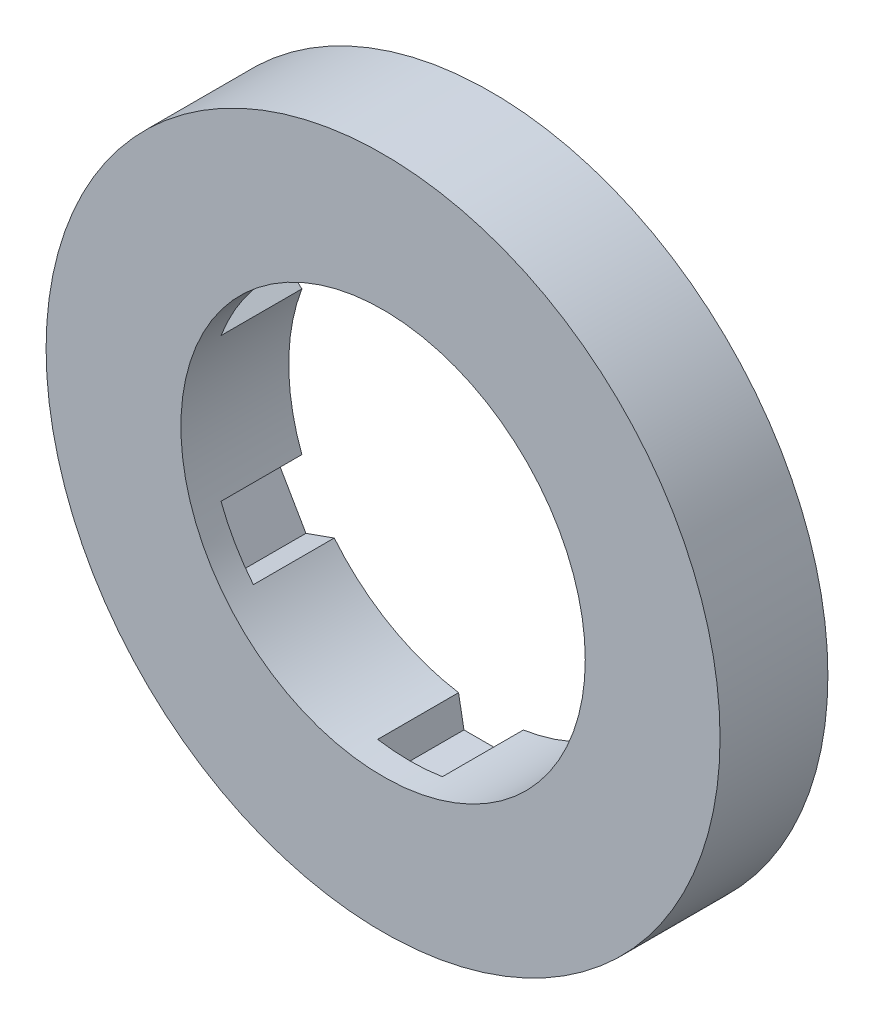
ISO-10303-21;
HEADER;
FILE_DESCRIPTION(('STEP AP214'),'2;1');
FILE_NAME('part.step','',(''),(''),'','','');
FILE_SCHEMA(('AUTOMOTIVE_DESIGN { 1 0 10303 214 1 1 1 1 }'));
ENDSEC;
DATA;
#1=APPLICATION_CONTEXT('core data for automotive mechanical design processes');
#2=APPLICATION_PROTOCOL_DEFINITION('international standard','automotive_design',2000,#1);
#3=PRODUCT_CONTEXT('',#1,'mechanical');
#4=PRODUCT('Part','Part','',(#3));
#5=PRODUCT_RELATED_PRODUCT_CATEGORY('part','',(#4));
#6=PRODUCT_DEFINITION_FORMATION('','',#4);
#7=PRODUCT_DEFINITION_CONTEXT('part definition',#1,'design');
#8=PRODUCT_DEFINITION('design','',#6,#7);
#9=PRODUCT_DEFINITION_SHAPE('','',#8);
#10=(LENGTH_UNIT() NAMED_UNIT(*) SI_UNIT(.MILLI.,.METRE.));
#11=(NAMED_UNIT(*) PLANE_ANGLE_UNIT() SI_UNIT($,.RADIAN.));
#12=(NAMED_UNIT(*) SI_UNIT($,.STERADIAN.) SOLID_ANGLE_UNIT());
#13=UNCERTAINTY_MEASURE_WITH_UNIT(LENGTH_MEASURE(1.E-05),#10,'distance_accuracy_value','');
#14=(GEOMETRIC_REPRESENTATION_CONTEXT(3) GLOBAL_UNCERTAINTY_ASSIGNED_CONTEXT((#13)) GLOBAL_UNIT_ASSIGNED_CONTEXT((#10,
#11,#12)) REPRESENTATION_CONTEXT('',''));
#15=CARTESIAN_POINT('',(0.,0.,0.));
#16=DIRECTION('',(0.,0.,1.));
#17=DIRECTION('',(1.,0.,0.));
#18=AXIS2_PLACEMENT_3D('',#15,#16,#17);
#19=CARTESIAN_POINT('',(0.,0.,3.));
#20=DIRECTION('',(0.,0.,1.));
#21=DIRECTION('',(1.,0.,0.));
#22=AXIS2_PLACEMENT_3D('',#19,#20,#21);
#23=CYLINDRICAL_SURFACE('',#22,12.5);
#24=CARTESIAN_POINT('',(0.,0.,3.));
#25=DIRECTION('',(0.,0.,1.));
#26=DIRECTION('',(1.,0.,0.));
#27=AXIS2_PLACEMENT_3D('',#24,#25,#26);
#28=CIRCLE('',#27,12.5);
#29=CARTESIAN_POINT('',(12.5,0.,3.));
#30=VERTEX_POINT('',#29);
#31=EDGE_CURVE('E354',#30,#30,#28,.T.);
#32=ORIENTED_EDGE('',*,*,#31,.T.);
#33=EDGE_LOOP('',(#32));
#34=FACE_BOUND('',#33,.T.);
#35=CARTESIAN_POINT('',(0.,0.,7.));
#36=DIRECTION('',(0.,0.,1.));
#37=DIRECTION('',(1.,0.,0.));
#38=AXIS2_PLACEMENT_3D('',#35,#36,#37);
#39=CIRCLE('',#38,12.5);
#40=CARTESIAN_POINT('',(12.5,0.,7.));
#41=VERTEX_POINT('',#40);
#42=EDGE_CURVE('E358',#41,#41,#39,.T.);
#43=ORIENTED_EDGE('',*,*,#42,.F.);
#44=EDGE_LOOP('',(#43));
#45=FACE_BOUND('',#44,.T.);
#46=ADVANCED_FACE('F34',(#34,#45),#23,.T.);
#47=CARTESIAN_POINT('',(0.,0.,3.));
#48=DIRECTION('',(0.,0.,1.));
#49=DIRECTION('',(1.,0.,0.));
#50=AXIS2_PLACEMENT_3D('',#47,#48,#49);
#51=PLANE('',#50);
#52=CARTESIAN_POINT('',(0.,0.,3.));
#53=DIRECTION('',(0.,0.,1.));
#54=DIRECTION('',(1.,0.,0.));
#55=AXIS2_PLACEMENT_3D('',#52,#53,#54);
#56=CIRCLE('',#55,7.5);
#57=CARTESIAN_POINT('',(5.8115130819487,4.74091928831731,3.));
#58=VERTEX_POINT('',#57);
#59=CARTESIAN_POINT('',(1.2,7.40337760755184,3.));
#60=VERTEX_POINT('',#59);
#61=EDGE_CURVE('E350',#58,#60,#56,.T.);
#62=ORIENTED_EDGE('',*,*,#61,.T.);
#63=DIRECTION('',(0.179418697155073,-0.983772804620648,0.));
#64=VECTOR('',#63,1.);
#65=CARTESIAN_POINT('',(1.2,7.40337760755184,3.));
#66=LINE('',#65,#64);
#67=CARTESIAN_POINT('',(1.,8.5,3.));
#68=VERTEX_POINT('',#67);
#69=EDGE_CURVE('E208',#68,#60,#66,.T.);
#70=ORIENTED_EDGE('',*,*,#69,.F.);
#71=DIRECTION('',(1.,0.,0.));
#72=VECTOR('',#71,1.);
#73=CARTESIAN_POINT('',(1.,8.5,3.));
#74=LINE('',#73,#72);
#75=CARTESIAN_POINT('',(-1.,8.5,3.));
#76=VERTEX_POINT('',#75);
#77=EDGE_CURVE('E427',#76,#68,#74,.T.);
#78=ORIENTED_EDGE('',*,*,#77,.F.);
#79=DIRECTION('',(0.179418697155073,0.983772804620648,0.));
#80=VECTOR('',#79,1.);
#81=CARTESIAN_POINT('',(-1.,8.5,3.));
#82=LINE('',#81,#80);
#83=CARTESIAN_POINT('',(-1.2,7.40337760755184,3.));
#84=VERTEX_POINT('',#83);
#85=EDGE_CURVE('E266',#84,#76,#82,.T.);
#86=ORIENTED_EDGE('',*,*,#85,.F.);
#87=CARTESIAN_POINT('',(-5.8115130819486,4.74091928831724,3.));
#88=VERTEX_POINT('',#87);
#89=EDGE_CURVE('E215',#84,#88,#56,.T.);
#90=ORIENTED_EDGE('',*,*,#89,.T.);
#91=DIRECTION('',(0.941681588931284,-0.336505252660122,0.));
#92=VECTOR('',#91,1.);
#93=CARTESIAN_POINT('',(-5.8115130819486,4.74091928831724,3.));
#94=LINE('',#93,#92);
#95=CARTESIAN_POINT('',(-6.86121593216757,5.11602540378444,3.));
#96=VERTEX_POINT('',#95);
#97=EDGE_CURVE('E250',#96,#88,#94,.T.);
#98=ORIENTED_EDGE('',*,*,#97,.F.);
#99=DIRECTION('',(0.499999999999998,0.86602540378444,0.));
#100=VECTOR('',#99,1.);
#101=CARTESIAN_POINT('',(-6.86121593216757,5.11602540378444,3.));
#102=LINE('',#101,#100);
#103=CARTESIAN_POINT('',(-7.86121593216757,3.38397459621556,3.));
#104=VERTEX_POINT('',#103);
#105=EDGE_CURVE('E259',#104,#96,#102,.T.);
#106=ORIENTED_EDGE('',*,*,#105,.F.);
#107=DIRECTION('',(-0.762262891776205,0.64726755196053,0.));
#108=VECTOR('',#107,1.);
#109=CARTESIAN_POINT('',(-7.86121593216757,3.38397459621556,3.));
#110=LINE('',#109,#108);
#111=CARTESIAN_POINT('',(-7.0115130819486,2.66245831923459,3.));
#112=VERTEX_POINT('',#111);
#113=EDGE_CURVE('E256',#112,#104,#110,.T.);
#114=ORIENTED_EDGE('',*,*,#113,.F.);
#115=CARTESIAN_POINT('',(-7.01151308194879,-2.66245831923461,3.));
#116=VERTEX_POINT('',#115);
#117=EDGE_CURVE('E412',#112,#116,#56,.T.);
#118=ORIENTED_EDGE('',*,*,#117,.T.);
#119=DIRECTION('',(0.762262891776207,0.647267551960527,0.));
#120=VECTOR('',#119,1.);
#121=CARTESIAN_POINT('',(-7.01151308194879,-2.66245831923461,3.));
#122=LINE('',#121,#120);
#123=CARTESIAN_POINT('',(-7.86121593216776,-3.38397459621558,3.));
#124=VERTEX_POINT('',#123);
#125=EDGE_CURVE('E276',#124,#116,#122,.T.);
#126=ORIENTED_EDGE('',*,*,#125,.F.);
#127=DIRECTION('',(-0.5,0.866025403784439,0.));
#128=VECTOR('',#127,1.);
#129=CARTESIAN_POINT('',(-7.86121593216776,-3.38397459621558,3.));
#130=LINE('',#129,#128);
#131=CARTESIAN_POINT('',(-6.86121593216777,-5.11602540378445,3.));
#132=VERTEX_POINT('',#131);
#133=EDGE_CURVE('E285',#132,#124,#130,.T.);
#134=ORIENTED_EDGE('',*,*,#133,.F.);
#135=DIRECTION('',(-0.941681588931285,-0.336505252660119,0.));
#136=VECTOR('',#135,1.);
#137=CARTESIAN_POINT('',(-6.86121593216777,-5.11602540378445,3.));
#138=LINE('',#137,#136);
#139=CARTESIAN_POINT('',(-5.81151308194879,-4.74091928831726,3.));
#140=VERTEX_POINT('',#139);
#141=EDGE_CURVE('E282',#140,#132,#138,.T.);
#142=ORIENTED_EDGE('',*,*,#141,.F.);
#143=CARTESIAN_POINT('',(-1.20000000000003,-7.40337760755187,3.));
#144=VERTEX_POINT('',#143);
#145=EDGE_CURVE('E410',#140,#144,#56,.T.);
#146=ORIENTED_EDGE('',*,*,#145,.T.);
#147=DIRECTION('',(-0.179418697155077,0.983772804620648,0.));
#148=VECTOR('',#147,1.);
#149=CARTESIAN_POINT('',(-1.20000000000003,-7.40337760755187,3.));
#150=LINE('',#149,#148);
#151=CARTESIAN_POINT('',(-1.00000000000003,-8.50000000000003,3.));
#152=VERTEX_POINT('',#151);
#153=EDGE_CURVE('E301',#152,#144,#150,.T.);
#154=ORIENTED_EDGE('',*,*,#153,.F.);
#155=DIRECTION('',(-1.,0.,0.));
#156=VECTOR('',#155,1.);
#157=CARTESIAN_POINT('',(-1.00000000000003,-8.50000000000003,3.));
#158=LINE('',#157,#156);
#159=CARTESIAN_POINT('',(0.999999999999966,-8.50000000000003,3.));
#160=VERTEX_POINT('',#159);
#161=EDGE_CURVE('E310',#160,#152,#158,.T.);
#162=ORIENTED_EDGE('',*,*,#161,.F.);
#163=DIRECTION('',(-0.179418697155078,-0.983772804620648,0.));
#164=VECTOR('',#163,1.);
#165=CARTESIAN_POINT('',(0.999999999999966,-8.50000000000003,3.));
#166=LINE('',#165,#164);
#167=CARTESIAN_POINT('',(1.19999999999997,-7.40337760755187,3.));
#168=VERTEX_POINT('',#167);
#169=EDGE_CURVE('E307',#168,#160,#166,.T.);
#170=ORIENTED_EDGE('',*,*,#169,.F.);
#171=CARTESIAN_POINT('',(5.81151308194874,-4.74091928831728,3.));
#172=VERTEX_POINT('',#171);
#173=EDGE_CURVE('E348',#168,#172,#56,.T.);
#174=ORIENTED_EDGE('',*,*,#173,.T.);
#175=DIRECTION('',(-0.941681588931285,0.33650525266012,0.));
#176=VECTOR('',#175,1.);
#177=CARTESIAN_POINT('',(5.81151308194874,-4.74091928831728,3.));
#178=LINE('',#177,#176);
#179=CARTESIAN_POINT('',(6.86121593216772,-5.11602540378447,3.));
#180=VERTEX_POINT('',#179);
#181=EDGE_CURVE('E326',#180,#172,#178,.T.);
#182=ORIENTED_EDGE('',*,*,#181,.F.);
#183=DIRECTION('',(-0.500000000000001,-0.866025403784438,0.));
#184=VECTOR('',#183,1.);
#185=CARTESIAN_POINT('',(6.86121593216772,-5.11602540378447,3.));
#186=LINE('',#185,#184);
#187=CARTESIAN_POINT('',(7.86121593216772,-3.3839745962156,3.));
#188=VERTEX_POINT('',#187);
#189=EDGE_CURVE('E334',#188,#180,#186,.T.);
#190=ORIENTED_EDGE('',*,*,#189,.F.);
#191=DIRECTION('',(0.762262891776207,-0.647267551960527,0.));
#192=VECTOR('',#191,1.);
#193=CARTESIAN_POINT('',(7.86121593216772,-3.3839745962156,3.));
#194=LINE('',#193,#192);
#195=CARTESIAN_POINT('',(7.01151308194874,-2.66245831923463,3.));
#196=VERTEX_POINT('',#195);
#197=EDGE_CURVE('E240',#196,#188,#194,.T.);
#198=ORIENTED_EDGE('',*,*,#197,.F.);
#199=CARTESIAN_POINT('',(7.01151308194872,2.66245831923468,3.));
#200=VERTEX_POINT('',#199);
#201=EDGE_CURVE('E345',#196,#200,#56,.T.);
#202=ORIENTED_EDGE('',*,*,#201,.T.);
#203=DIRECTION('',(-0.762262891776269,-0.647267551960454,0.));
#204=VECTOR('',#203,1.);
#205=CARTESIAN_POINT('',(7.01151308194872,2.66245831923468,3.));
#206=LINE('',#205,#204);
#207=CARTESIAN_POINT('',(7.86121593216773,3.38397459621554,3.));
#208=VERTEX_POINT('',#207);
#209=EDGE_CURVE('E226',#208,#200,#206,.T.);
#210=ORIENTED_EDGE('',*,*,#209,.F.);
#211=DIRECTION('',(0.500000000000002,-0.866025403784437,0.));
#212=VECTOR('',#211,1.);
#213=CARTESIAN_POINT('',(7.86121593216773,3.38397459621554,3.));
#214=LINE('',#213,#212);
#215=CARTESIAN_POINT('',(6.86121593216767,5.11602540378452,3.));
#216=VERTEX_POINT('',#215);
#217=EDGE_CURVE('E233',#216,#208,#214,.T.);
#218=ORIENTED_EDGE('',*,*,#217,.F.);
#219=DIRECTION('',(0.941681588931279,0.336505252660135,0.));
#220=VECTOR('',#219,1.);
#221=CARTESIAN_POINT('',(6.86121593216767,5.11602540378452,3.));
#222=LINE('',#221,#220);
#223=EDGE_CURVE('E230',#58,#216,#222,.T.);
#224=ORIENTED_EDGE('',*,*,#223,.F.);
#225=EDGE_LOOP('',(#62,#70,#78,#86,#90,#98,#106,#114,#118,#126,#134,#142,#146,#154,#162,#170,
#174,#182,#190,#198,#202,#210,#218,#224));
#226=FACE_BOUND('',#225,.T.);
#227=ORIENTED_EDGE('',*,*,#31,.F.);
#228=EDGE_LOOP('',(#227));
#229=FACE_BOUND('',#228,.T.);
#230=ADVANCED_FACE('F389',(#226,#229),#51,.F.);
#231=CARTESIAN_POINT('',(0.,0.,7.));
#232=DIRECTION('',(0.,0.,1.));
#233=DIRECTION('',(1.,0.,0.));
#234=AXIS2_PLACEMENT_3D('',#231,#232,#233);
#235=PLANE('',#234);
#236=CARTESIAN_POINT('',(0.,0.,7.));
#237=DIRECTION('',(0.,0.,1.));
#238=DIRECTION('',(1.,0.,0.));
#239=AXIS2_PLACEMENT_3D('',#236,#237,#238);
#240=CIRCLE('',#239,7.5);
#241=CARTESIAN_POINT('',(7.5,0.,7.));
#242=VERTEX_POINT('',#241);
#243=EDGE_CURVE('E349',#242,#242,#240,.T.);
#244=ORIENTED_EDGE('',*,*,#243,.F.);
#245=EDGE_LOOP('',(#244));
#246=FACE_BOUND('',#245,.T.);
#247=ORIENTED_EDGE('',*,*,#42,.T.);
#248=EDGE_LOOP('',(#247));
#249=FACE_BOUND('',#248,.T.);
#250=ADVANCED_FACE('F447',(#246,#249),#235,.T.);
#251=CARTESIAN_POINT('',(0.,0.,3.));
#252=DIRECTION('',(0.,0.,1.));
#253=DIRECTION('',(1.,0.,0.));
#254=AXIS2_PLACEMENT_3D('',#251,#252,#253);
#255=CYLINDRICAL_SURFACE('',#254,7.5);
#256=CARTESIAN_POINT('',(0.,0.,6.));
#257=DIRECTION('',(0.,0.,1.));
#258=DIRECTION('',(1.,0.,0.));
#259=AXIS2_PLACEMENT_3D('',#256,#257,#258);
#260=CIRCLE('',#259,7.5);
#261=CARTESIAN_POINT('',(-1.2,7.40337760755184,6.));
#262=VERTEX_POINT('',#261);
#263=CARTESIAN_POINT('',(1.2,7.40337760755184,6.));
#264=VERTEX_POINT('',#263);
#265=EDGE_CURVE('E11',#262,#264,#260,.F.);
#266=ORIENTED_EDGE('',*,*,#265,.T.);
#267=DIRECTION('',(0.,0.,-1.));
#268=VECTOR('',#267,1.);
#269=CARTESIAN_POINT('',(1.2,7.40337760755184,6.));
#270=LINE('',#269,#268);
#271=EDGE_CURVE('E353',#264,#60,#270,.T.);
#272=ORIENTED_EDGE('',*,*,#271,.T.);
#273=ORIENTED_EDGE('',*,*,#61,.F.);
#274=DIRECTION('',(0.,0.,-1.));
#275=VECTOR('',#274,1.);
#276=CARTESIAN_POINT('',(5.8115130819487,4.74091928831731,6.));
#277=LINE('',#276,#275);
#278=CARTESIAN_POINT('',(5.8115130819487,4.74091928831731,6.));
#279=VERTEX_POINT('',#278);
#280=EDGE_CURVE('E229',#279,#58,#277,.T.);
#281=ORIENTED_EDGE('',*,*,#280,.F.);
#282=CARTESIAN_POINT('',(0.,0.,6.));
#283=DIRECTION('',(0.,0.,1.));
#284=DIRECTION('',(1.,0.,0.));
#285=AXIS2_PLACEMENT_3D('',#282,#283,#284);
#286=CIRCLE('',#285,7.5);
#287=CARTESIAN_POINT('',(7.01151308194872,2.66245831923468,6.));
#288=VERTEX_POINT('',#287);
#289=EDGE_CURVE('E41',#279,#288,#286,.F.);
#290=ORIENTED_EDGE('',*,*,#289,.T.);
#291=DIRECTION('',(0.,0.,-1.));
#292=VECTOR('',#291,1.);
#293=CARTESIAN_POINT('',(7.01151308194872,2.66245831923468,6.));
#294=LINE('',#293,#292);
#295=EDGE_CURVE('E237',#288,#200,#294,.T.);
#296=ORIENTED_EDGE('',*,*,#295,.T.);
#297=ORIENTED_EDGE('',*,*,#201,.F.);
#298=DIRECTION('',(0.,0.,-1.));
#299=VECTOR('',#298,1.);
#300=CARTESIAN_POINT('',(7.01151308194874,-2.66245831923463,6.));
#301=LINE('',#300,#299);
#302=CARTESIAN_POINT('',(7.01151308194874,-2.66245831923463,6.));
#303=VERTEX_POINT('',#302);
#304=EDGE_CURVE('E331',#303,#196,#301,.T.);
#305=ORIENTED_EDGE('',*,*,#304,.F.);
#306=CARTESIAN_POINT('',(0.,0.,6.));
#307=DIRECTION('',(0.,0.,1.));
#308=DIRECTION('',(1.,0.,0.));
#309=AXIS2_PLACEMENT_3D('',#306,#307,#308);
#310=CIRCLE('',#309,7.5);
#311=CARTESIAN_POINT('',(5.81151308194873,-4.74091928831728,6.));
#312=VERTEX_POINT('',#311);
#313=EDGE_CURVE('E369',#303,#312,#310,.F.);
#314=ORIENTED_EDGE('',*,*,#313,.T.);
#315=DIRECTION('',(0.,0.,-1.));
#316=VECTOR('',#315,1.);
#317=CARTESIAN_POINT('',(5.81151308194874,-4.74091928831728,6.));
#318=LINE('',#317,#316);
#319=EDGE_CURVE('E311',#312,#172,#318,.T.);
#320=ORIENTED_EDGE('',*,*,#319,.T.);
#321=ORIENTED_EDGE('',*,*,#173,.F.);
#322=DIRECTION('',(0.,0.,-1.));
#323=VECTOR('',#322,1.);
#324=CARTESIAN_POINT('',(1.19999999999997,-7.40337760755187,6.));
#325=LINE('',#324,#323);
#326=CARTESIAN_POINT('',(1.19999999999997,-7.40337760755187,6.));
#327=VERTEX_POINT('',#326);
#328=EDGE_CURVE('E306',#327,#168,#325,.T.);
#329=ORIENTED_EDGE('',*,*,#328,.F.);
#330=CARTESIAN_POINT('',(0.,0.,6.));
#331=DIRECTION('',(0.,0.,1.));
#332=DIRECTION('',(1.,0.,0.));
#333=AXIS2_PLACEMENT_3D('',#330,#331,#332);
#334=CIRCLE('',#333,7.5);
#335=CARTESIAN_POINT('',(-1.19999999999981,-7.40337760755187,6.));
#336=VERTEX_POINT('',#335);
#337=EDGE_CURVE('E366',#327,#336,#334,.F.);
#338=ORIENTED_EDGE('',*,*,#337,.T.);
#339=DIRECTION('',(0.,0.,-1.));
#340=VECTOR('',#339,1.);
#341=CARTESIAN_POINT('',(-1.20000000000003,-7.40337760755187,6.));
#342=LINE('',#341,#340);
#343=EDGE_CURVE('E286',#336,#144,#342,.T.);
#344=ORIENTED_EDGE('',*,*,#343,.T.);
#345=ORIENTED_EDGE('',*,*,#145,.F.);
#346=DIRECTION('',(0.,0.,-1.));
#347=VECTOR('',#346,1.);
#348=CARTESIAN_POINT('',(-5.81151308194879,-4.74091928831726,6.));
#349=LINE('',#348,#347);
#350=CARTESIAN_POINT('',(-5.81151308194879,-4.74091928831726,6.));
#351=VERTEX_POINT('',#350);
#352=EDGE_CURVE('E281',#351,#140,#349,.T.);
#353=ORIENTED_EDGE('',*,*,#352,.F.);
#354=CARTESIAN_POINT('',(0.,0.,6.));
#355=DIRECTION('',(0.,0.,1.));
#356=DIRECTION('',(1.,0.,0.));
#357=AXIS2_PLACEMENT_3D('',#354,#355,#356);
#358=CIRCLE('',#357,7.5);
#359=CARTESIAN_POINT('',(-7.01151308194867,-2.66245831923482,6.));
#360=VERTEX_POINT('',#359);
#361=EDGE_CURVE('E363',#351,#360,#358,.F.);
#362=ORIENTED_EDGE('',*,*,#361,.T.);
#363=DIRECTION('',(0.,0.,-1.));
#364=VECTOR('',#363,1.);
#365=CARTESIAN_POINT('',(-7.01151308194879,-2.66245831923461,6.));
#366=LINE('',#365,#364);
#367=EDGE_CURVE('E260',#360,#116,#366,.T.);
#368=ORIENTED_EDGE('',*,*,#367,.T.);
#369=ORIENTED_EDGE('',*,*,#117,.F.);
#370=DIRECTION('',(0.,0.,-1.));
#371=VECTOR('',#370,1.);
#372=CARTESIAN_POINT('',(-7.0115130819486,2.66245831923459,6.));
#373=LINE('',#372,#371);
#374=CARTESIAN_POINT('',(-7.0115130819486,2.66245831923459,6.));
#375=VERTEX_POINT('',#374);
#376=EDGE_CURVE('E255',#375,#112,#373,.T.);
#377=ORIENTED_EDGE('',*,*,#376,.F.);
#378=CARTESIAN_POINT('',(0.,0.,6.));
#379=DIRECTION('',(0.,0.,1.));
#380=DIRECTION('',(1.,0.,0.));
#381=AXIS2_PLACEMENT_3D('',#378,#379,#380);
#382=CIRCLE('',#381,7.5);
#383=CARTESIAN_POINT('',(-5.81151308194872,4.74091928831729,6.));
#384=VERTEX_POINT('',#383);
#385=EDGE_CURVE('E357',#375,#384,#382,.F.);
#386=ORIENTED_EDGE('',*,*,#385,.T.);
#387=DIRECTION('',(0.,0.,-1.));
#388=VECTOR('',#387,1.);
#389=CARTESIAN_POINT('',(-5.8115130819486,4.74091928831724,6.));
#390=LINE('',#389,#388);
#391=EDGE_CURVE('E264',#384,#88,#390,.T.);
#392=ORIENTED_EDGE('',*,*,#391,.T.);
#393=ORIENTED_EDGE('',*,*,#89,.F.);
#394=DIRECTION('',(0.,0.,-1.));
#395=VECTOR('',#394,1.);
#396=CARTESIAN_POINT('',(-1.2,7.40337760755184,6.));
#397=LINE('',#396,#395);
#398=EDGE_CURVE('E203',#262,#84,#397,.T.);
#399=ORIENTED_EDGE('',*,*,#398,.F.);
#400=EDGE_LOOP('',(#266,#272,#273,#281,#290,#296,#297,#305,#314,#320,#321,#329,#338,#344,#345,
#353,#362,#368,#369,#377,#386,#392,#393,#399));
#401=FACE_BOUND('',#400,.T.);
#402=ORIENTED_EDGE('',*,*,#243,.T.);
#403=EDGE_LOOP('',(#402));
#404=FACE_BOUND('',#403,.T.);
#405=ADVANCED_FACE('F211',(#401,#404),#255,.F.);
#406=CARTESIAN_POINT('',(0.,0.,6.));
#407=DIRECTION('',(0.,0.,1.));
#408=DIRECTION('',(1.,0.,0.));
#409=AXIS2_PLACEMENT_3D('',#406,#407,#408);
#410=PLANE('',#409);
#411=DIRECTION('',(-0.762262891776205,0.64726755196053,0.));
#412=VECTOR('',#411,1.);
#413=CARTESIAN_POINT('',(-7.86121593216757,3.38397459621556,6.));
#414=LINE('',#413,#412);
#415=CARTESIAN_POINT('',(-7.86121593216757,3.38397459621556,6.));
#416=VERTEX_POINT('',#415);
#417=EDGE_CURVE('E246',#375,#416,#414,.T.);
#418=ORIENTED_EDGE('',*,*,#417,.T.);
#419=DIRECTION('',(0.499999999999998,0.86602540378444,0.));
#420=VECTOR('',#419,1.);
#421=CARTESIAN_POINT('',(-6.86121593216757,5.11602540378444,6.));
#422=LINE('',#421,#420);
#423=CARTESIAN_POINT('',(-6.86121593216757,5.11602540378444,6.));
#424=VERTEX_POINT('',#423);
#425=EDGE_CURVE('E249',#416,#424,#422,.T.);
#426=ORIENTED_EDGE('',*,*,#425,.T.);
#427=DIRECTION('',(0.941681588931284,-0.336505252660122,0.));
#428=VECTOR('',#427,1.);
#429=CARTESIAN_POINT('',(-5.8115130819486,4.74091928831724,6.));
#430=LINE('',#429,#428);
#431=EDGE_CURVE('E253',#424,#384,#430,.T.);
#432=ORIENTED_EDGE('',*,*,#431,.T.);
#433=ORIENTED_EDGE('',*,*,#385,.F.);
#434=EDGE_LOOP('',(#418,#426,#432,#433));
#435=FACE_BOUND('',#434,.T.);
#436=ADVANCED_FACE('F458',(#435),#410,.F.);
#437=CARTESIAN_POINT('',(-5.8115130819486,4.74091928831724,6.));
#438=DIRECTION('',(0.336505252660122,0.941681588931284,0.));
#439=DIRECTION('',(-0.941681588931284,0.336505252660122,0.));
#440=AXIS2_PLACEMENT_3D('',#437,#438,#439);
#441=PLANE('',#440);
#442=ORIENTED_EDGE('',*,*,#97,.T.);
#443=ORIENTED_EDGE('',*,*,#391,.F.);
#444=ORIENTED_EDGE('',*,*,#431,.F.);
#445=DIRECTION('',(0.,0.,-1.));
#446=VECTOR('',#445,1.);
#447=CARTESIAN_POINT('',(-6.86121593216757,5.11602540378444,6.));
#448=LINE('',#447,#446);
#449=EDGE_CURVE('E267',#424,#96,#448,.T.);
#450=ORIENTED_EDGE('',*,*,#449,.T.);
#451=EDGE_LOOP('',(#442,#443,#444,#450));
#452=FACE_BOUND('',#451,.T.);
#453=ADVANCED_FACE('F511',(#452),#441,.F.);
#454=CARTESIAN_POINT('',(-6.86121593216757,5.11602540378444,6.));
#455=DIRECTION('',(-0.86602540378444,0.499999999999998,0.));
#456=DIRECTION('',(-0.499999999999998,-0.86602540378444,0.));
#457=AXIS2_PLACEMENT_3D('',#454,#455,#456);
#458=PLANE('',#457);
#459=ORIENTED_EDGE('',*,*,#105,.T.);
#460=ORIENTED_EDGE('',*,*,#449,.F.);
#461=ORIENTED_EDGE('',*,*,#425,.F.);
#462=DIRECTION('',(0.,0.,-1.));
#463=VECTOR('',#462,1.);
#464=CARTESIAN_POINT('',(-7.86121593216757,3.38397459621556,6.));
#465=LINE('',#464,#463);
#466=EDGE_CURVE('E269',#416,#104,#465,.T.);
#467=ORIENTED_EDGE('',*,*,#466,.T.);
#468=EDGE_LOOP('',(#459,#460,#461,#467));
#469=FACE_BOUND('',#468,.T.);
#470=ADVANCED_FACE('F507',(#469),#458,.F.);
#471=CARTESIAN_POINT('',(-7.86121593216757,3.38397459621556,6.));
#472=DIRECTION('',(-0.64726755196053,-0.762262891776205,0.));
#473=DIRECTION('',(0.762262891776205,-0.64726755196053,0.));
#474=AXIS2_PLACEMENT_3D('',#471,#472,#473);
#475=PLANE('',#474);
#476=ORIENTED_EDGE('',*,*,#113,.T.);
#477=ORIENTED_EDGE('',*,*,#466,.F.);
#478=ORIENTED_EDGE('',*,*,#417,.F.);
#479=ORIENTED_EDGE('',*,*,#376,.T.);
#480=EDGE_LOOP('',(#476,#477,#478,#479));
#481=FACE_BOUND('',#480,.T.);
#482=ADVANCED_FACE('F503',(#481),#475,.F.);
#483=CARTESIAN_POINT('',(0.,0.,6.));
#484=DIRECTION('',(0.,0.,1.));
#485=DIRECTION('',(1.,0.,0.));
#486=AXIS2_PLACEMENT_3D('',#483,#484,#485);
#487=PLANE('',#486);
#488=DIRECTION('',(-0.941681588931285,-0.336505252660119,0.));
#489=VECTOR('',#488,1.);
#490=CARTESIAN_POINT('',(-6.86121593216777,-5.11602540378445,6.));
#491=LINE('',#490,#489);
#492=CARTESIAN_POINT('',(-6.86121593216777,-5.11602540378445,6.));
#493=VERTEX_POINT('',#492);
#494=EDGE_CURVE('E272',#351,#493,#491,.T.);
#495=ORIENTED_EDGE('',*,*,#494,.T.);
#496=DIRECTION('',(-0.5,0.866025403784439,0.));
#497=VECTOR('',#496,1.);
#498=CARTESIAN_POINT('',(-7.86121593216776,-3.38397459621558,6.));
#499=LINE('',#498,#497);
#500=CARTESIAN_POINT('',(-7.86121593216776,-3.38397459621558,6.));
#501=VERTEX_POINT('',#500);
#502=EDGE_CURVE('E275',#493,#501,#499,.T.);
#503=ORIENTED_EDGE('',*,*,#502,.T.);
#504=DIRECTION('',(0.762262891776207,0.647267551960527,0.));
#505=VECTOR('',#504,1.);
#506=CARTESIAN_POINT('',(-7.01151308194879,-2.66245831923461,6.));
#507=LINE('',#506,#505);
#508=EDGE_CURVE('E279',#501,#360,#507,.T.);
#509=ORIENTED_EDGE('',*,*,#508,.T.);
#510=ORIENTED_EDGE('',*,*,#361,.F.);
#511=EDGE_LOOP('',(#495,#503,#509,#510));
#512=FACE_BOUND('',#511,.T.);
#513=ADVANCED_FACE('F499',(#512),#487,.F.);
#514=CARTESIAN_POINT('',(-7.01151308194879,-2.66245831923461,6.));
#515=DIRECTION('',(-0.647267551960527,0.762262891776207,0.));
#516=DIRECTION('',(-0.762262891776207,-0.647267551960527,0.));
#517=AXIS2_PLACEMENT_3D('',#514,#515,#516);
#518=PLANE('',#517);
#519=ORIENTED_EDGE('',*,*,#125,.T.);
#520=ORIENTED_EDGE('',*,*,#367,.F.);
#521=ORIENTED_EDGE('',*,*,#508,.F.);
#522=DIRECTION('',(0.,0.,-1.));
#523=VECTOR('',#522,1.);
#524=CARTESIAN_POINT('',(-7.86121593216776,-3.38397459621558,6.));
#525=LINE('',#524,#523);
#526=EDGE_CURVE('E292',#501,#124,#525,.T.);
#527=ORIENTED_EDGE('',*,*,#526,.T.);
#528=EDGE_LOOP('',(#519,#520,#521,#527));
#529=FACE_BOUND('',#528,.T.);
#530=ADVANCED_FACE('F495',(#529),#518,.F.);
#531=CARTESIAN_POINT('',(-7.86121593216776,-3.38397459621558,6.));
#532=DIRECTION('',(-0.866025403784439,-0.5,0.));
#533=DIRECTION('',(0.5,-0.866025403784439,0.));
#534=AXIS2_PLACEMENT_3D('',#531,#532,#533);
#535=PLANE('',#534);
#536=ORIENTED_EDGE('',*,*,#133,.T.);
#537=ORIENTED_EDGE('',*,*,#526,.F.);
#538=ORIENTED_EDGE('',*,*,#502,.F.);
#539=DIRECTION('',(0.,0.,-1.));
#540=VECTOR('',#539,1.);
#541=CARTESIAN_POINT('',(-6.86121593216777,-5.11602540378445,6.));
#542=LINE('',#541,#540);
#543=EDGE_CURVE('E294',#493,#132,#542,.T.);
#544=ORIENTED_EDGE('',*,*,#543,.T.);
#545=EDGE_LOOP('',(#536,#537,#538,#544));
#546=FACE_BOUND('',#545,.T.);
#547=ADVANCED_FACE('F491',(#546),#535,.F.);
#548=CARTESIAN_POINT('',(-6.86121593216777,-5.11602540378445,6.));
#549=DIRECTION('',(0.336505252660119,-0.941681588931285,0.));
#550=DIRECTION('',(0.941681588931285,0.336505252660119,0.));
#551=AXIS2_PLACEMENT_3D('',#548,#549,#550);
#552=PLANE('',#551);
#553=ORIENTED_EDGE('',*,*,#141,.T.);
#554=ORIENTED_EDGE('',*,*,#543,.F.);
#555=ORIENTED_EDGE('',*,*,#494,.F.);
#556=ORIENTED_EDGE('',*,*,#352,.T.);
#557=EDGE_LOOP('',(#553,#554,#555,#556));
#558=FACE_BOUND('',#557,.T.);
#559=ADVANCED_FACE('F487',(#558),#552,.F.);
#560=CARTESIAN_POINT('',(0.,0.,6.));
#561=DIRECTION('',(0.,0.,1.));
#562=DIRECTION('',(1.,0.,0.));
#563=AXIS2_PLACEMENT_3D('',#560,#561,#562);
#564=PLANE('',#563);
#565=DIRECTION('',(-0.179418697155078,-0.983772804620648,0.));
#566=VECTOR('',#565,1.);
#567=CARTESIAN_POINT('',(0.999999999999966,-8.50000000000003,6.));
#568=LINE('',#567,#566);
#569=CARTESIAN_POINT('',(0.999999999999966,-8.50000000000003,6.));
#570=VERTEX_POINT('',#569);
#571=EDGE_CURVE('E297',#327,#570,#568,.T.);
#572=ORIENTED_EDGE('',*,*,#571,.T.);
#573=DIRECTION('',(-1.,0.,0.));
#574=VECTOR('',#573,1.);
#575=CARTESIAN_POINT('',(-1.00000000000003,-8.50000000000003,6.));
#576=LINE('',#575,#574);
#577=CARTESIAN_POINT('',(-1.00000000000003,-8.50000000000003,6.));
#578=VERTEX_POINT('',#577);
#579=EDGE_CURVE('E300',#570,#578,#576,.T.);
#580=ORIENTED_EDGE('',*,*,#579,.T.);
#581=DIRECTION('',(-0.179418697155077,0.983772804620648,0.));
#582=VECTOR('',#581,1.);
#583=CARTESIAN_POINT('',(-1.20000000000003,-7.40337760755187,6.));
#584=LINE('',#583,#582);
#585=EDGE_CURVE('E304',#578,#336,#584,.T.);
#586=ORIENTED_EDGE('',*,*,#585,.T.);
#587=ORIENTED_EDGE('',*,*,#337,.F.);
#588=EDGE_LOOP('',(#572,#580,#586,#587));
#589=FACE_BOUND('',#588,.T.);
#590=ADVANCED_FACE('F483',(#589),#564,.F.);
#591=CARTESIAN_POINT('',(-1.20000000000003,-7.40337760755187,6.));
#592=DIRECTION('',(-0.983772804620648,-0.179418697155077,0.));
#593=DIRECTION('',(0.179418697155077,-0.983772804620648,0.));
#594=AXIS2_PLACEMENT_3D('',#591,#592,#593);
#595=PLANE('',#594);
#596=ORIENTED_EDGE('',*,*,#153,.T.);
#597=ORIENTED_EDGE('',*,*,#343,.F.);
#598=ORIENTED_EDGE('',*,*,#585,.F.);
#599=DIRECTION('',(0.,0.,-1.));
#600=VECTOR('',#599,1.);
#601=CARTESIAN_POINT('',(-1.00000000000003,-8.50000000000003,6.));
#602=LINE('',#601,#600);
#603=EDGE_CURVE('E317',#578,#152,#602,.T.);
#604=ORIENTED_EDGE('',*,*,#603,.T.);
#605=EDGE_LOOP('',(#596,#597,#598,#604));
#606=FACE_BOUND('',#605,.T.);
#607=ADVANCED_FACE('F479',(#606),#595,.F.);
#608=CARTESIAN_POINT('',(-1.00000000000003,-8.50000000000003,6.));
#609=DIRECTION('',(0.,-1.,0.));
#610=DIRECTION('',(0.,0.,-1.));
#611=AXIS2_PLACEMENT_3D('',#608,#609,#610);
#612=PLANE('',#611);
#613=ORIENTED_EDGE('',*,*,#161,.T.);
#614=ORIENTED_EDGE('',*,*,#603,.F.);
#615=ORIENTED_EDGE('',*,*,#579,.F.);
#616=DIRECTION('',(0.,0.,-1.));
#617=VECTOR('',#616,1.);
#618=CARTESIAN_POINT('',(0.999999999999966,-8.50000000000003,6.));
#619=LINE('',#618,#617);
#620=EDGE_CURVE('E319',#570,#160,#619,.T.);
#621=ORIENTED_EDGE('',*,*,#620,.T.);
#622=EDGE_LOOP('',(#613,#614,#615,#621));
#623=FACE_BOUND('',#622,.T.);
#624=ADVANCED_FACE('F475',(#623),#612,.F.);
#625=CARTESIAN_POINT('',(0.999999999999966,-8.50000000000003,6.));
#626=DIRECTION('',(0.983772804620647,-0.179418697155078,0.));
#627=DIRECTION('',(0.179418697155078,0.983772804620647,0.));
#628=AXIS2_PLACEMENT_3D('',#625,#626,#627);
#629=PLANE('',#628);
#630=ORIENTED_EDGE('',*,*,#169,.T.);
#631=ORIENTED_EDGE('',*,*,#620,.F.);
#632=ORIENTED_EDGE('',*,*,#571,.F.);
#633=ORIENTED_EDGE('',*,*,#328,.T.);
#634=EDGE_LOOP('',(#630,#631,#632,#633));
#635=FACE_BOUND('',#634,.T.);
#636=ADVANCED_FACE('F472',(#635),#629,.F.);
#637=CARTESIAN_POINT('',(0.,0.,6.));
#638=DIRECTION('',(0.,0.,1.));
#639=DIRECTION('',(1.,0.,0.));
#640=AXIS2_PLACEMENT_3D('',#637,#638,#639);
#641=PLANE('',#640);
#642=DIRECTION('',(0.762262891776207,-0.647267551960527,0.));
#643=VECTOR('',#642,1.);
#644=CARTESIAN_POINT('',(7.86121593216772,-3.3839745962156,6.));
#645=LINE('',#644,#643);
#646=CARTESIAN_POINT('',(7.86121593216772,-3.3839745962156,6.));
#647=VERTEX_POINT('',#646);
#648=EDGE_CURVE('E322',#303,#647,#645,.T.);
#649=ORIENTED_EDGE('',*,*,#648,.T.);
#650=DIRECTION('',(-0.500000000000001,-0.866025403784438,0.));
#651=VECTOR('',#650,1.);
#652=CARTESIAN_POINT('',(6.86121593216772,-5.11602540378447,6.));
#653=LINE('',#652,#651);
#654=CARTESIAN_POINT('',(6.86121593216772,-5.11602540378447,6.));
#655=VERTEX_POINT('',#654);
#656=EDGE_CURVE('E325',#647,#655,#653,.T.);
#657=ORIENTED_EDGE('',*,*,#656,.T.);
#658=DIRECTION('',(-0.941681588931285,0.33650525266012,0.));
#659=VECTOR('',#658,1.);
#660=CARTESIAN_POINT('',(5.81151308194874,-4.74091928831728,6.));
#661=LINE('',#660,#659);
#662=EDGE_CURVE('E329',#655,#312,#661,.T.);
#663=ORIENTED_EDGE('',*,*,#662,.T.);
#664=ORIENTED_EDGE('',*,*,#313,.F.);
#665=EDGE_LOOP('',(#649,#657,#663,#664));
#666=FACE_BOUND('',#665,.T.);
#667=ADVANCED_FACE('F399',(#666),#641,.F.);
#668=CARTESIAN_POINT('',(5.81151308194874,-4.74091928831728,6.));
#669=DIRECTION('',(-0.33650525266012,-0.941681588931284,0.));
#670=DIRECTION('',(0.941681588931285,-0.33650525266012,0.));
#671=AXIS2_PLACEMENT_3D('',#668,#669,#670);
#672=PLANE('',#671);
#673=ORIENTED_EDGE('',*,*,#181,.T.);
#674=ORIENTED_EDGE('',*,*,#319,.F.);
#675=ORIENTED_EDGE('',*,*,#662,.F.);
#676=DIRECTION('',(0.,0.,-1.));
#677=VECTOR('',#676,1.);
#678=CARTESIAN_POINT('',(6.86121593216772,-5.11602540378447,6.));
#679=LINE('',#678,#677);
#680=EDGE_CURVE('E340',#655,#180,#679,.T.);
#681=ORIENTED_EDGE('',*,*,#680,.T.);
#682=EDGE_LOOP('',(#673,#674,#675,#681));
#683=FACE_BOUND('',#682,.T.);
#684=ADVANCED_FACE('F403',(#683),#672,.F.);
#685=CARTESIAN_POINT('',(6.86121593216772,-5.11602540378447,6.));
#686=DIRECTION('',(0.866025403784438,-0.500000000000001,0.));
#687=DIRECTION('',(0.500000000000001,0.866025403784438,0.));
#688=AXIS2_PLACEMENT_3D('',#685,#686,#687);
#689=PLANE('',#688);
#690=ORIENTED_EDGE('',*,*,#189,.T.);
#691=ORIENTED_EDGE('',*,*,#680,.F.);
#692=ORIENTED_EDGE('',*,*,#656,.F.);
#693=DIRECTION('',(0.,0.,-1.));
#694=VECTOR('',#693,1.);
#695=CARTESIAN_POINT('',(7.86121593216772,-3.3839745962156,6.));
#696=LINE('',#695,#694);
#697=EDGE_CURVE('E342',#647,#188,#696,.T.);
#698=ORIENTED_EDGE('',*,*,#697,.T.);
#699=EDGE_LOOP('',(#690,#691,#692,#698));
#700=FACE_BOUND('',#699,.T.);
#701=ADVANCED_FACE('F464',(#700),#689,.F.);
#702=CARTESIAN_POINT('',(7.86121593216772,-3.3839745962156,6.));
#703=DIRECTION('',(0.647267551960527,0.762262891776207,0.));
#704=DIRECTION('',(-0.762262891776208,0.647267551960527,0.));
#705=AXIS2_PLACEMENT_3D('',#702,#703,#704);
#706=PLANE('',#705);
#707=ORIENTED_EDGE('',*,*,#197,.T.);
#708=ORIENTED_EDGE('',*,*,#697,.F.);
#709=ORIENTED_EDGE('',*,*,#648,.F.);
#710=ORIENTED_EDGE('',*,*,#304,.T.);
#711=EDGE_LOOP('',(#707,#708,#709,#710));
#712=FACE_BOUND('',#711,.T.);
#713=ADVANCED_FACE('F396',(#712),#706,.F.);
#714=CARTESIAN_POINT('',(0.,0.,6.));
#715=DIRECTION('',(0.,0.,1.));
#716=DIRECTION('',(1.,0.,0.));
#717=AXIS2_PLACEMENT_3D('',#714,#715,#716);
#718=PLANE('',#717);
#719=DIRECTION('',(0.941681588931279,0.336505252660135,0.));
#720=VECTOR('',#719,1.);
#721=CARTESIAN_POINT('',(6.86121593216767,5.11602540378452,6.));
#722=LINE('',#721,#720);
#723=CARTESIAN_POINT('',(6.86121593216767,5.11602540378452,6.));
#724=VERTEX_POINT('',#723);
#725=EDGE_CURVE('E222',#279,#724,#722,.T.);
#726=ORIENTED_EDGE('',*,*,#725,.T.);
#727=DIRECTION('',(0.500000000000002,-0.866025403784437,0.));
#728=VECTOR('',#727,1.);
#729=CARTESIAN_POINT('',(7.86121593216773,3.38397459621554,6.));
#730=LINE('',#729,#728);
#731=CARTESIAN_POINT('',(7.86121593216773,3.38397459621554,6.));
#732=VERTEX_POINT('',#731);
#733=EDGE_CURVE('E225',#724,#732,#730,.T.);
#734=ORIENTED_EDGE('',*,*,#733,.T.);
#735=DIRECTION('',(-0.762262891776269,-0.647267551960454,0.));
#736=VECTOR('',#735,1.);
#737=CARTESIAN_POINT('',(7.01151308194872,2.66245831923468,6.));
#738=LINE('',#737,#736);
#739=EDGE_CURVE('E56',#732,#288,#738,.T.);
#740=ORIENTED_EDGE('',*,*,#739,.T.);
#741=ORIENTED_EDGE('',*,*,#289,.F.);
#742=EDGE_LOOP('',(#726,#734,#740,#741));
#743=FACE_BOUND('',#742,.T.);
#744=ADVANCED_FACE('F376',(#743),#718,.F.);
#745=CARTESIAN_POINT('',(7.01151308194872,2.66245831923468,6.));
#746=DIRECTION('',(0.647267551960454,-0.762262891776269,0.));
#747=DIRECTION('',(0.762262891776269,0.647267551960454,0.));
#748=AXIS2_PLACEMENT_3D('',#745,#746,#747);
#749=PLANE('',#748);
#750=ORIENTED_EDGE('',*,*,#209,.T.);
#751=ORIENTED_EDGE('',*,*,#295,.F.);
#752=ORIENTED_EDGE('',*,*,#739,.F.);
#753=DIRECTION('',(0.,0.,-1.));
#754=VECTOR('',#753,1.);
#755=CARTESIAN_POINT('',(7.86121593216773,3.38397459621554,6.));
#756=LINE('',#755,#754);
#757=EDGE_CURVE('E241',#732,#208,#756,.T.);
#758=ORIENTED_EDGE('',*,*,#757,.T.);
#759=EDGE_LOOP('',(#750,#751,#752,#758));
#760=FACE_BOUND('',#759,.T.);
#761=ADVANCED_FACE('F385',(#760),#749,.F.);
#762=CARTESIAN_POINT('',(7.86121593216773,3.38397459621554,6.));
#763=DIRECTION('',(0.866025403784437,0.500000000000002,0.));
#764=DIRECTION('',(-0.500000000000002,0.866025403784438,0.));
#765=AXIS2_PLACEMENT_3D('',#762,#763,#764);
#766=PLANE('',#765);
#767=ORIENTED_EDGE('',*,*,#217,.T.);
#768=ORIENTED_EDGE('',*,*,#757,.F.);
#769=ORIENTED_EDGE('',*,*,#733,.F.);
#770=DIRECTION('',(0.,0.,-1.));
#771=VECTOR('',#770,1.);
#772=CARTESIAN_POINT('',(6.86121593216767,5.11602540378452,6.));
#773=LINE('',#772,#771);
#774=EDGE_CURVE('E243',#724,#216,#773,.T.);
#775=ORIENTED_EDGE('',*,*,#774,.T.);
#776=EDGE_LOOP('',(#767,#768,#769,#775));
#777=FACE_BOUND('',#776,.T.);
#778=ADVANCED_FACE('F383',(#777),#766,.F.);
#779=CARTESIAN_POINT('',(6.86121593216767,5.11602540378452,6.));
#780=DIRECTION('',(-0.336505252660135,0.941681588931279,0.));
#781=DIRECTION('',(-0.941681588931279,-0.336505252660135,0.));
#782=AXIS2_PLACEMENT_3D('',#779,#780,#781);
#783=PLANE('',#782);
#784=ORIENTED_EDGE('',*,*,#223,.T.);
#785=ORIENTED_EDGE('',*,*,#774,.F.);
#786=ORIENTED_EDGE('',*,*,#725,.F.);
#787=ORIENTED_EDGE('',*,*,#280,.T.);
#788=EDGE_LOOP('',(#784,#785,#786,#787));
#789=FACE_BOUND('',#788,.T.);
#790=ADVANCED_FACE('F378',(#789),#783,.F.);
#791=CARTESIAN_POINT('',(0.,0.,6.));
#792=DIRECTION('',(0.,0.,1.));
#793=DIRECTION('',(1.,0.,0.));
#794=AXIS2_PLACEMENT_3D('',#791,#792,#793);
#795=PLANE('',#794);
#796=DIRECTION('',(0.179418697155073,0.983772804620648,0.));
#797=VECTOR('',#796,1.);
#798=CARTESIAN_POINT('',(-1.,8.5,6.));
#799=LINE('',#798,#797);
#800=CARTESIAN_POINT('',(-1.,8.5,6.));
#801=VERTEX_POINT('',#800);
#802=EDGE_CURVE('E196',#262,#801,#799,.T.);
#803=ORIENTED_EDGE('',*,*,#802,.T.);
#804=DIRECTION('',(1.,0.,0.));
#805=VECTOR('',#804,1.);
#806=CARTESIAN_POINT('',(1.,8.5,6.));
#807=LINE('',#806,#805);
#808=CARTESIAN_POINT('',(1.,8.5,6.));
#809=VERTEX_POINT('',#808);
#810=EDGE_CURVE('E207',#801,#809,#807,.T.);
#811=ORIENTED_EDGE('',*,*,#810,.T.);
#812=DIRECTION('',(0.179418697155073,-0.983772804620648,0.));
#813=VECTOR('',#812,1.);
#814=CARTESIAN_POINT('',(1.2,7.40337760755184,6.));
#815=LINE('',#814,#813);
#816=EDGE_CURVE('E48',#809,#264,#815,.T.);
#817=ORIENTED_EDGE('',*,*,#816,.T.);
#818=ORIENTED_EDGE('',*,*,#265,.F.);
#819=EDGE_LOOP('',(#803,#811,#817,#818));
#820=FACE_BOUND('',#819,.T.);
#821=ADVANCED_FACE('F195',(#820),#795,.F.);
#822=CARTESIAN_POINT('',(1.2,7.40337760755184,6.));
#823=DIRECTION('',(0.983772804620648,0.179418697155073,0.));
#824=DIRECTION('',(-0.179418697155073,0.983772804620648,0.));
#825=AXIS2_PLACEMENT_3D('',#822,#823,#824);
#826=PLANE('',#825);
#827=ORIENTED_EDGE('',*,*,#69,.T.);
#828=ORIENTED_EDGE('',*,*,#271,.F.);
#829=ORIENTED_EDGE('',*,*,#816,.F.);
#830=DIRECTION('',(0.,0.,-1.));
#831=VECTOR('',#830,1.);
#832=CARTESIAN_POINT('',(1.,8.5,6.));
#833=LINE('',#832,#831);
#834=EDGE_CURVE('E217',#809,#68,#833,.T.);
#835=ORIENTED_EDGE('',*,*,#834,.T.);
#836=EDGE_LOOP('',(#827,#828,#829,#835));
#837=FACE_BOUND('',#836,.T.);
#838=ADVANCED_FACE('F432',(#837),#826,.F.);
#839=CARTESIAN_POINT('',(1.,8.5,6.));
#840=DIRECTION('',(0.,1.,0.));
#841=DIRECTION('',(0.,0.,1.));
#842=AXIS2_PLACEMENT_3D('',#839,#840,#841);
#843=PLANE('',#842);
#844=ORIENTED_EDGE('',*,*,#77,.T.);
#845=ORIENTED_EDGE('',*,*,#834,.F.);
#846=ORIENTED_EDGE('',*,*,#810,.F.);
#847=DIRECTION('',(0.,0.,-1.));
#848=VECTOR('',#847,1.);
#849=CARTESIAN_POINT('',(-1.,8.5,6.));
#850=LINE('',#849,#848);
#851=EDGE_CURVE('E205',#801,#76,#850,.T.);
#852=ORIENTED_EDGE('',*,*,#851,.T.);
#853=EDGE_LOOP('',(#844,#845,#846,#852));
#854=FACE_BOUND('',#853,.T.);
#855=ADVANCED_FACE('F433',(#854),#843,.F.);
#856=CARTESIAN_POINT('',(-1.,8.5,6.));
#857=DIRECTION('',(-0.983772804620648,0.179418697155073,0.));
#858=DIRECTION('',(-0.179418697155073,-0.983772804620648,0.));
#859=AXIS2_PLACEMENT_3D('',#856,#857,#858);
#860=PLANE('',#859);
#861=ORIENTED_EDGE('',*,*,#85,.T.);
#862=ORIENTED_EDGE('',*,*,#851,.F.);
#863=ORIENTED_EDGE('',*,*,#802,.F.);
#864=ORIENTED_EDGE('',*,*,#398,.T.);
#865=EDGE_LOOP('',(#861,#862,#863,#864));
#866=FACE_BOUND('',#865,.T.);
#867=ADVANCED_FACE('F202',(#866),#860,.F.);
#868=CLOSED_SHELL('',(#46,#230,#250,#405,#436,#453,#470,#482,#513,#530,#547,#559,#590,#607,#624,
#636,#667,#684,#701,#713,#744,#761,#778,#790,#821,#838,#855,#867));
#869=MANIFOLD_SOLID_BREP('B2',#868);
#870=ADVANCED_BREP_SHAPE_REPRESENTATION('',(#18,#869),#14);
#871=SHAPE_DEFINITION_REPRESENTATION(#9,#870);
ENDSEC;
END-ISO-10303-21;
